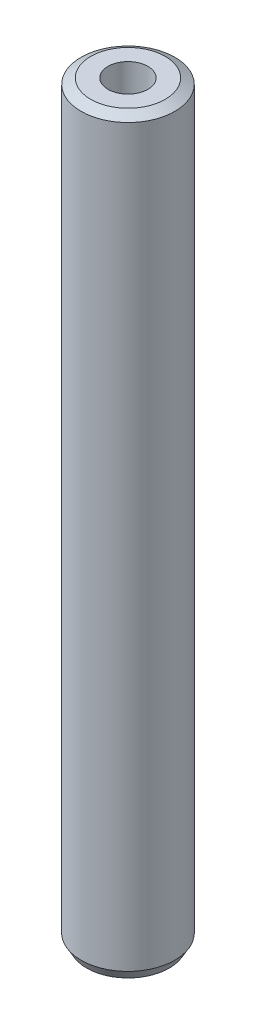
ISO-10303-21;
HEADER;
FILE_DESCRIPTION(('STEP AP214'),'2;1');
FILE_NAME('part.step','',(''),(''),'','','');
FILE_SCHEMA(('AUTOMOTIVE_DESIGN { 1 0 10303 214 1 1 1 1 }'));
ENDSEC;
DATA;
#1=APPLICATION_CONTEXT('core data for automotive mechanical design processes');
#2=APPLICATION_PROTOCOL_DEFINITION('international standard','automotive_design',2000,#1);
#3=PRODUCT_CONTEXT('',#1,'mechanical');
#4=PRODUCT('Part','Part','',(#3));
#5=PRODUCT_RELATED_PRODUCT_CATEGORY('part','',(#4));
#6=PRODUCT_DEFINITION_FORMATION('','',#4);
#7=PRODUCT_DEFINITION_CONTEXT('part definition',#1,'design');
#8=PRODUCT_DEFINITION('design','',#6,#7);
#9=PRODUCT_DEFINITION_SHAPE('','',#8);
#10=(LENGTH_UNIT() NAMED_UNIT(*) SI_UNIT(.MILLI.,.METRE.));
#11=(NAMED_UNIT(*) PLANE_ANGLE_UNIT() SI_UNIT($,.RADIAN.));
#12=(NAMED_UNIT(*) SI_UNIT($,.STERADIAN.) SOLID_ANGLE_UNIT());
#13=UNCERTAINTY_MEASURE_WITH_UNIT(LENGTH_MEASURE(1.E-05),#10,'distance_accuracy_value','');
#14=(GEOMETRIC_REPRESENTATION_CONTEXT(3) GLOBAL_UNCERTAINTY_ASSIGNED_CONTEXT((#13)) GLOBAL_UNIT_ASSIGNED_CONTEXT((#10,
#11,#12)) REPRESENTATION_CONTEXT('',''));
#15=CARTESIAN_POINT('',(0.,0.,0.));
#16=DIRECTION('',(0.,0.,1.));
#17=DIRECTION('',(1.,0.,0.));
#18=AXIS2_PLACEMENT_3D('',#15,#16,#17);
#19=CARTESIAN_POINT('',(0.,600.,0.));
#20=DIRECTION('',(0.,-1.,0.));
#21=DIRECTION('',(0.,0.,-1.));
#22=AXIS2_PLACEMENT_3D('',#19,#20,#21);
#23=CYLINDRICAL_SURFACE('',#22,37.5);
#24=CARTESIAN_POINT('',(0.,595.547185073003,0.));
#25=DIRECTION('',(0.,1.,0.));
#26=DIRECTION('',(0.,0.,1.));
#27=AXIS2_PLACEMENT_3D('',#24,#25,#26);
#28=CIRCLE('',#27,37.5);
#29=CARTESIAN_POINT('',(0.,595.547185073003,37.5));
#30=VERTEX_POINT('',#29);
#31=EDGE_CURVE('E50',#30,#30,#28,.F.);
#32=ORIENTED_EDGE('',*,*,#31,.T.);
#33=EDGE_LOOP('',(#32));
#34=FACE_BOUND('',#33,.T.);
#35=CARTESIAN_POINT('',(0.,7.71250169025983,0.));
#36=DIRECTION('',(0.,1.,0.));
#37=DIRECTION('',(0.,0.,1.));
#38=AXIS2_PLACEMENT_3D('',#35,#36,#37);
#39=CIRCLE('',#38,37.5);
#40=CARTESIAN_POINT('',(0.,7.71250169025983,37.5));
#41=VERTEX_POINT('',#40);
#42=EDGE_CURVE('E51',#41,#41,#39,.T.);
#43=ORIENTED_EDGE('',*,*,#42,.T.);
#44=EDGE_LOOP('',(#43));
#45=FACE_BOUND('',#44,.T.);
#46=ADVANCED_FACE('F39',(#34,#45),#23,.T.);
#47=CARTESIAN_POINT('',(0.,600.,0.));
#48=DIRECTION('',(0.,1.,0.));
#49=DIRECTION('',(0.,0.,1.));
#50=AXIS2_PLACEMENT_3D('',#47,#48,#49);
#51=PLANE('',#50);
#52=CARTESIAN_POINT('',(0.,600.,0.));
#53=DIRECTION('',(0.,1.,0.));
#54=DIRECTION('',(0.,0.,1.));
#55=AXIS2_PLACEMENT_3D('',#52,#53,#54);
#56=CIRCLE('',#55,29.7874983097399);
#57=CARTESIAN_POINT('',(0.,600.,29.7874983097399));
#58=VERTEX_POINT('',#57);
#59=EDGE_CURVE('E54',#58,#58,#56,.T.);
#60=ORIENTED_EDGE('',*,*,#59,.T.);
#61=EDGE_LOOP('',(#60));
#62=FACE_BOUND('',#61,.T.);
#63=CARTESIAN_POINT('',(0.,600.,0.));
#64=DIRECTION('',(0.,1.,0.));
#65=DIRECTION('',(0.,0.,1.));
#66=AXIS2_PLACEMENT_3D('',#63,#64,#65);
#67=CIRCLE('',#66,15.9565716141836);
#68=CARTESIAN_POINT('',(0.,600.,15.9565716141836));
#69=VERTEX_POINT('',#68);
#70=EDGE_CURVE('E58',#69,#69,#67,.T.);
#71=ORIENTED_EDGE('',*,*,#70,.F.);
#72=EDGE_LOOP('',(#71));
#73=FACE_BOUND('',#72,.T.);
#74=ADVANCED_FACE('F69',(#62,#73),#51,.T.);
#75=CARTESIAN_POINT('',(0.,0.,0.));
#76=DIRECTION('',(0.,1.,0.));
#77=DIRECTION('',(0.,0.,1.));
#78=AXIS2_PLACEMENT_3D('',#75,#76,#77);
#79=PLANE('',#78);
#80=CARTESIAN_POINT('',(0.,0.,0.));
#81=DIRECTION('',(0.,1.,0.));
#82=DIRECTION('',(0.,0.,1.));
#83=AXIS2_PLACEMENT_3D('',#80,#81,#82);
#84=CIRCLE('',#83,33.047185073003);
#85=CARTESIAN_POINT('',(0.,0.,33.047185073003));
#86=VERTEX_POINT('',#85);
#87=EDGE_CURVE('E10',#86,#86,#84,.F.);
#88=ORIENTED_EDGE('',*,*,#87,.T.);
#89=EDGE_LOOP('',(#88));
#90=FACE_BOUND('',#89,.T.);
#91=CARTESIAN_POINT('',(0.,0.,0.));
#92=DIRECTION('',(0.,1.,0.));
#93=DIRECTION('',(0.,0.,1.));
#94=AXIS2_PLACEMENT_3D('',#91,#92,#93);
#95=CIRCLE('',#94,15.9565716141836);
#96=CARTESIAN_POINT('',(0.,0.,15.9565716141836));
#97=VERTEX_POINT('',#96);
#98=EDGE_CURVE('E63',#97,#97,#95,.T.);
#99=ORIENTED_EDGE('',*,*,#98,.T.);
#100=EDGE_LOOP('',(#99));
#101=FACE_BOUND('',#100,.T.);
#102=ADVANCED_FACE('F75',(#90,#101),#79,.F.);
#103=CARTESIAN_POINT('',(0.,600.,0.));
#104=DIRECTION('',(0.,-1.,0.));
#105=DIRECTION('',(0.,0.,-1.));
#106=AXIS2_PLACEMENT_3D('',#103,#104,#105);
#107=CYLINDRICAL_SURFACE('',#106,15.9565716141836);
#108=ORIENTED_EDGE('',*,*,#70,.T.);
#109=EDGE_LOOP('',(#108));
#110=FACE_BOUND('',#109,.T.);
#111=ORIENTED_EDGE('',*,*,#98,.F.);
#112=EDGE_LOOP('',(#111));
#113=FACE_BOUND('',#112,.T.);
#114=ADVANCED_FACE('F70',(#110,#113),#107,.F.);
#115=CARTESIAN_POINT('',(0.,600.,0.));
#116=DIRECTION('',(0.,-1.,0.));
#117=DIRECTION('',(0.,0.,-1.));
#118=AXIS2_PLACEMENT_3D('',#115,#116,#117);
#119=CONICAL_SURFACE('',#118,29.7874983097399,1.0471975511966);
#120=ORIENTED_EDGE('',*,*,#31,.F.);
#121=EDGE_LOOP('',(#120));
#122=FACE_BOUND('',#121,.T.);
#123=ORIENTED_EDGE('',*,*,#59,.F.);
#124=EDGE_LOOP('',(#123));
#125=FACE_BOUND('',#124,.T.);
#126=ADVANCED_FACE('F81',(#122,#125),#119,.T.);
#127=CARTESIAN_POINT('',(0.,7.71250169025983,0.));
#128=DIRECTION('',(0.,1.,0.));
#129=DIRECTION('',(0.,0.,1.));
#130=AXIS2_PLACEMENT_3D('',#127,#128,#129);
#131=CONICAL_SURFACE('',#130,37.5,0.523598775598301);
#132=ORIENTED_EDGE('',*,*,#87,.F.);
#133=EDGE_LOOP('',(#132));
#134=FACE_BOUND('',#133,.T.);
#135=ORIENTED_EDGE('',*,*,#42,.F.);
#136=EDGE_LOOP('',(#135));
#137=FACE_BOUND('',#136,.T.);
#138=ADVANCED_FACE('F45',(#134,#137),#131,.T.);
#139=CLOSED_SHELL('',(#46,#74,#102,#114,#126,#138));
#140=MANIFOLD_SOLID_BREP('B2',#139);
#141=ADVANCED_BREP_SHAPE_REPRESENTATION('',(#18,#140),#14);
#142=SHAPE_DEFINITION_REPRESENTATION(#9,#141);
ENDSEC;
END-ISO-10303-21;
